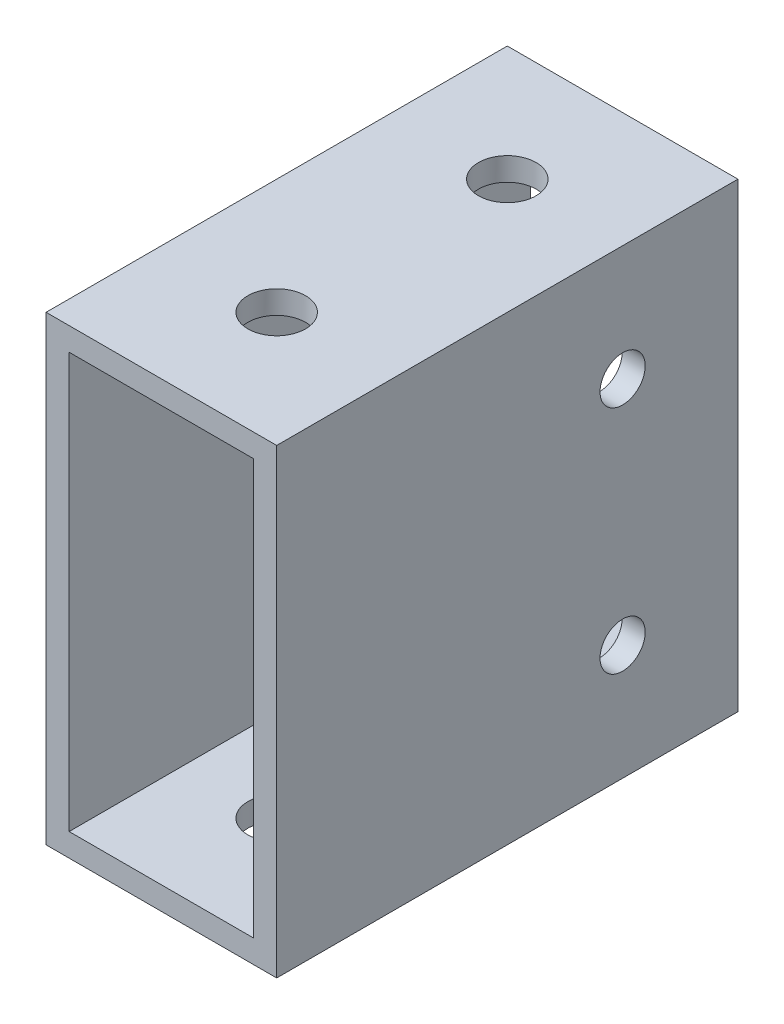
ISO-10303-21;
HEADER;
FILE_DESCRIPTION(('STEP AP214'),'2;1');
FILE_NAME('part.step','',(''),(''),'','','');
FILE_SCHEMA(('AUTOMOTIVE_DESIGN { 1 0 10303 214 1 1 1 1 }'));
ENDSEC;
DATA;
#1=APPLICATION_CONTEXT('core data for automotive mechanical design processes');
#2=APPLICATION_PROTOCOL_DEFINITION('international standard','automotive_design',2000,#1);
#3=PRODUCT_CONTEXT('',#1,'mechanical');
#4=PRODUCT('Part','Part','',(#3));
#5=PRODUCT_RELATED_PRODUCT_CATEGORY('part','',(#4));
#6=PRODUCT_DEFINITION_FORMATION('','',#4);
#7=PRODUCT_DEFINITION_CONTEXT('part definition',#1,'design');
#8=PRODUCT_DEFINITION('design','',#6,#7);
#9=PRODUCT_DEFINITION_SHAPE('','',#8);
#10=(LENGTH_UNIT() NAMED_UNIT(*) SI_UNIT(.MILLI.,.METRE.));
#11=(NAMED_UNIT(*) PLANE_ANGLE_UNIT() SI_UNIT($,.RADIAN.));
#12=(NAMED_UNIT(*) SI_UNIT($,.STERADIAN.) SOLID_ANGLE_UNIT());
#13=UNCERTAINTY_MEASURE_WITH_UNIT(LENGTH_MEASURE(1.E-05),#10,'distance_accuracy_value','');
#14=(GEOMETRIC_REPRESENTATION_CONTEXT(3) GLOBAL_UNCERTAINTY_ASSIGNED_CONTEXT((#13)) GLOBAL_UNIT_ASSIGNED_CONTEXT((#10,
#11,#12)) REPRESENTATION_CONTEXT('',''));
#15=CARTESIAN_POINT('',(0.,0.,0.));
#16=DIRECTION('',(0.,0.,1.));
#17=DIRECTION('',(1.,0.,0.));
#18=AXIS2_PLACEMENT_3D('',#15,#16,#17);
#19=CARTESIAN_POINT('',(0.,0.,25.4));
#20=DIRECTION('',(0.,0.,1.));
#21=DIRECTION('',(1.,0.,0.));
#22=AXIS2_PLACEMENT_3D('',#19,#20,#21);
#23=PLANE('',#22);
#24=DIRECTION('',(0.,1.,0.));
#25=VECTOR('',#24,1.);
#26=CARTESIAN_POINT('',(12.7,-25.4,25.4));
#27=LINE('',#26,#25);
#28=CARTESIAN_POINT('',(12.7,-25.4,25.4));
#29=VERTEX_POINT('',#28);
#30=CARTESIAN_POINT('',(12.7,25.4,25.4));
#31=VERTEX_POINT('',#30);
#32=EDGE_CURVE('E163',#29,#31,#27,.T.);
#33=ORIENTED_EDGE('',*,*,#32,.T.);
#34=DIRECTION('',(-1.,0.,0.));
#35=VECTOR('',#34,1.);
#36=CARTESIAN_POINT('',(-12.7,25.4,25.4));
#37=LINE('',#36,#35);
#38=CARTESIAN_POINT('',(-12.7,25.4,25.4));
#39=VERTEX_POINT('',#38);
#40=EDGE_CURVE('E166',#31,#39,#37,.T.);
#41=ORIENTED_EDGE('',*,*,#40,.T.);
#42=DIRECTION('',(0.,-1.,0.));
#43=VECTOR('',#42,1.);
#44=CARTESIAN_POINT('',(-12.7,-25.4,25.4));
#45=LINE('',#44,#43);
#46=CARTESIAN_POINT('',(-12.7,-25.4,25.4));
#47=VERTEX_POINT('',#46);
#48=EDGE_CURVE('E169',#39,#47,#45,.T.);
#49=ORIENTED_EDGE('',*,*,#48,.T.);
#50=DIRECTION('',(1.,0.,0.));
#51=VECTOR('',#50,1.);
#52=CARTESIAN_POINT('',(-12.7,-25.4,25.4));
#53=LINE('',#52,#51);
#54=EDGE_CURVE('E171',#47,#29,#53,.T.);
#55=ORIENTED_EDGE('',*,*,#54,.T.);
#56=EDGE_LOOP('',(#33,#41,#49,#55));
#57=FACE_BOUND('',#56,.T.);
#58=DIRECTION('',(-1.,0.,0.));
#59=VECTOR('',#58,1.);
#60=CARTESIAN_POINT('',(0.,22.86,25.4));
#61=LINE('',#60,#59);
#62=CARTESIAN_POINT('',(10.16,22.86,25.4));
#63=VERTEX_POINT('',#62);
#64=CARTESIAN_POINT('',(-10.16,22.86,25.4));
#65=VERTEX_POINT('',#64);
#66=EDGE_CURVE('E133',#63,#65,#61,.T.);
#67=ORIENTED_EDGE('',*,*,#66,.F.);
#68=DIRECTION('',(0.,1.,0.));
#69=VECTOR('',#68,1.);
#70=CARTESIAN_POINT('',(10.16,0.,25.4));
#71=LINE('',#70,#69);
#72=CARTESIAN_POINT('',(10.16,-22.86,25.4));
#73=VERTEX_POINT('',#72);
#74=EDGE_CURVE('E125',#73,#63,#71,.T.);
#75=ORIENTED_EDGE('',*,*,#74,.F.);
#76=DIRECTION('',(1.,0.,0.));
#77=VECTOR('',#76,1.);
#78=CARTESIAN_POINT('',(0.,-22.86,25.4));
#79=LINE('',#78,#77);
#80=CARTESIAN_POINT('',(-10.16,-22.86,25.4));
#81=VERTEX_POINT('',#80);
#82=EDGE_CURVE('E147',#81,#73,#79,.T.);
#83=ORIENTED_EDGE('',*,*,#82,.F.);
#84=DIRECTION('',(0.,-1.,0.));
#85=VECTOR('',#84,1.);
#86=CARTESIAN_POINT('',(-10.16,0.,25.4));
#87=LINE('',#86,#85);
#88=EDGE_CURVE('E145',#65,#81,#87,.T.);
#89=ORIENTED_EDGE('',*,*,#88,.F.);
#90=EDGE_LOOP('',(#67,#75,#83,#89));
#91=FACE_BOUND('',#90,.T.);
#92=ADVANCED_FACE('F58',(#57,#91),#23,.T.);
#93=CARTESIAN_POINT('',(0.,0.,-25.4));
#94=DIRECTION('',(0.,0.,1.));
#95=DIRECTION('',(1.,0.,0.));
#96=AXIS2_PLACEMENT_3D('',#93,#94,#95);
#97=PLANE('',#96);
#98=DIRECTION('',(0.,1.,0.));
#99=VECTOR('',#98,1.);
#100=CARTESIAN_POINT('',(12.7,-25.4,-25.4));
#101=LINE('',#100,#99);
#102=CARTESIAN_POINT('',(12.7,-25.4,-25.4));
#103=VERTEX_POINT('',#102);
#104=CARTESIAN_POINT('',(12.7,25.4,-25.4));
#105=VERTEX_POINT('',#104);
#106=EDGE_CURVE('E141',#103,#105,#101,.T.);
#107=ORIENTED_EDGE('',*,*,#106,.F.);
#108=DIRECTION('',(1.,0.,0.));
#109=VECTOR('',#108,1.);
#110=CARTESIAN_POINT('',(-12.7,-25.4,-25.4));
#111=LINE('',#110,#109);
#112=CARTESIAN_POINT('',(-12.7,-25.4,-25.4));
#113=VERTEX_POINT('',#112);
#114=EDGE_CURVE('E167',#113,#103,#111,.T.);
#115=ORIENTED_EDGE('',*,*,#114,.F.);
#116=DIRECTION('',(0.,-1.,0.));
#117=VECTOR('',#116,1.);
#118=CARTESIAN_POINT('',(-12.7,-25.4,-25.4));
#119=LINE('',#118,#117);
#120=CARTESIAN_POINT('',(-12.7,25.4,-25.4));
#121=VERTEX_POINT('',#120);
#122=EDGE_CURVE('E178',#121,#113,#119,.T.);
#123=ORIENTED_EDGE('',*,*,#122,.F.);
#124=DIRECTION('',(-1.,0.,0.));
#125=VECTOR('',#124,1.);
#126=CARTESIAN_POINT('',(-12.7,25.4,-25.4));
#127=LINE('',#126,#125);
#128=EDGE_CURVE('E176',#105,#121,#127,.T.);
#129=ORIENTED_EDGE('',*,*,#128,.F.);
#130=EDGE_LOOP('',(#107,#115,#123,#129));
#131=FACE_BOUND('',#130,.T.);
#132=DIRECTION('',(0.,1.,0.));
#133=VECTOR('',#132,1.);
#134=CARTESIAN_POINT('',(10.16,0.,-25.4));
#135=LINE('',#134,#133);
#136=CARTESIAN_POINT('',(10.16,-22.86,-25.4));
#137=VERTEX_POINT('',#136);
#138=CARTESIAN_POINT('',(10.16,22.86,-25.4));
#139=VERTEX_POINT('',#138);
#140=EDGE_CURVE('E83',#137,#139,#135,.T.);
#141=ORIENTED_EDGE('',*,*,#140,.T.);
#142=DIRECTION('',(-1.,0.,0.));
#143=VECTOR('',#142,1.);
#144=CARTESIAN_POINT('',(0.,22.86,-25.4));
#145=LINE('',#144,#143);
#146=CARTESIAN_POINT('',(-10.16,22.86,-25.4));
#147=VERTEX_POINT('',#146);
#148=EDGE_CURVE('E140',#139,#147,#145,.T.);
#149=ORIENTED_EDGE('',*,*,#148,.T.);
#150=DIRECTION('',(0.,-1.,0.));
#151=VECTOR('',#150,1.);
#152=CARTESIAN_POINT('',(-10.16,0.,-25.4));
#153=LINE('',#152,#151);
#154=CARTESIAN_POINT('',(-10.16,-22.86,-25.4));
#155=VERTEX_POINT('',#154);
#156=EDGE_CURVE('E155',#147,#155,#153,.T.);
#157=ORIENTED_EDGE('',*,*,#156,.T.);
#158=DIRECTION('',(1.,0.,0.));
#159=VECTOR('',#158,1.);
#160=CARTESIAN_POINT('',(0.,-22.86,-25.4));
#161=LINE('',#160,#159);
#162=EDGE_CURVE('E134',#155,#137,#161,.T.);
#163=ORIENTED_EDGE('',*,*,#162,.T.);
#164=EDGE_LOOP('',(#141,#149,#157,#163));
#165=FACE_BOUND('',#164,.T.);
#166=ADVANCED_FACE('F266',(#131,#165),#97,.F.);
#167=CARTESIAN_POINT('',(12.7,-25.4,25.4));
#168=DIRECTION('',(-1.,0.,0.));
#169=DIRECTION('',(0.,0.,1.));
#170=AXIS2_PLACEMENT_3D('',#167,#168,#169);
#171=PLANE('',#170);
#172=CARTESIAN_POINT('',(12.7,12.7,-12.7));
#173=DIRECTION('',(1.,0.,0.));
#174=DIRECTION('',(0.,0.,-1.));
#175=AXIS2_PLACEMENT_3D('',#172,#173,#174);
#176=CIRCLE('',#175,2.4892);
#177=CARTESIAN_POINT('',(12.7,12.7,-15.1892));
#178=VERTEX_POINT('',#177);
#179=EDGE_CURVE('E204',#178,#178,#176,.T.);
#180=ORIENTED_EDGE('',*,*,#179,.F.);
#181=EDGE_LOOP('',(#180));
#182=FACE_BOUND('',#181,.T.);
#183=CARTESIAN_POINT('',(12.7,-12.7,-12.7));
#184=DIRECTION('',(1.,0.,0.));
#185=DIRECTION('',(0.,0.,-1.));
#186=AXIS2_PLACEMENT_3D('',#183,#184,#185);
#187=CIRCLE('',#186,2.4892);
#188=CARTESIAN_POINT('',(12.7,-12.7,-15.1892));
#189=VERTEX_POINT('',#188);
#190=EDGE_CURVE('E214',#189,#189,#187,.T.);
#191=ORIENTED_EDGE('',*,*,#190,.F.);
#192=EDGE_LOOP('',(#191));
#193=FACE_BOUND('',#192,.T.);
#194=ORIENTED_EDGE('',*,*,#106,.T.);
#195=DIRECTION('',(0.,0.,-1.));
#196=VECTOR('',#195,1.);
#197=CARTESIAN_POINT('',(12.7,25.4,25.4));
#198=LINE('',#197,#196);
#199=EDGE_CURVE('E12',#31,#105,#198,.T.);
#200=ORIENTED_EDGE('',*,*,#199,.F.);
#201=ORIENTED_EDGE('',*,*,#32,.F.);
#202=DIRECTION('',(0.,0.,-1.));
#203=VECTOR('',#202,1.);
#204=CARTESIAN_POINT('',(12.7,-25.4,25.4));
#205=LINE('',#204,#203);
#206=EDGE_CURVE('E173',#29,#103,#205,.T.);
#207=ORIENTED_EDGE('',*,*,#206,.T.);
#208=EDGE_LOOP('',(#194,#200,#201,#207));
#209=FACE_BOUND('',#208,.T.);
#210=ADVANCED_FACE('F60',(#182,#193,#209),#171,.F.);
#211=CARTESIAN_POINT('',(-12.7,25.4,25.4));
#212=DIRECTION('',(0.,-1.,0.));
#213=DIRECTION('',(0.,0.,-1.));
#214=AXIS2_PLACEMENT_3D('',#211,#212,#213);
#215=PLANE('',#214);
#216=CARTESIAN_POINT('',(0.,25.4,-12.7));
#217=DIRECTION('',(0.,1.,0.));
#218=DIRECTION('',(0.,0.,1.));
#219=AXIS2_PLACEMENT_3D('',#216,#217,#218);
#220=CIRCLE('',#219,3.175);
#221=CARTESIAN_POINT('',(0.,25.4,-9.525));
#222=VERTEX_POINT('',#221);
#223=EDGE_CURVE('E223',#222,#222,#220,.T.);
#224=ORIENTED_EDGE('',*,*,#223,.F.);
#225=EDGE_LOOP('',(#224));
#226=FACE_BOUND('',#225,.T.);
#227=CARTESIAN_POINT('',(0.,25.4,12.7));
#228=DIRECTION('',(0.,1.,0.));
#229=DIRECTION('',(0.,0.,1.));
#230=AXIS2_PLACEMENT_3D('',#227,#228,#229);
#231=CIRCLE('',#230,3.175);
#232=CARTESIAN_POINT('',(0.,25.4,15.875));
#233=VERTEX_POINT('',#232);
#234=EDGE_CURVE('E220',#233,#233,#231,.T.);
#235=ORIENTED_EDGE('',*,*,#234,.F.);
#236=EDGE_LOOP('',(#235));
#237=FACE_BOUND('',#236,.T.);
#238=ORIENTED_EDGE('',*,*,#128,.T.);
#239=DIRECTION('',(0.,0.,-1.));
#240=VECTOR('',#239,1.);
#241=CARTESIAN_POINT('',(-12.7,25.4,25.4));
#242=LINE('',#241,#240);
#243=EDGE_CURVE('E67',#39,#121,#242,.T.);
#244=ORIENTED_EDGE('',*,*,#243,.F.);
#245=ORIENTED_EDGE('',*,*,#40,.F.);
#246=ORIENTED_EDGE('',*,*,#199,.T.);
#247=EDGE_LOOP('',(#238,#244,#245,#246));
#248=FACE_BOUND('',#247,.T.);
#249=ADVANCED_FACE('F252',(#226,#237,#248),#215,.F.);
#250=CARTESIAN_POINT('',(-12.7,-25.4,25.4));
#251=DIRECTION('',(1.,0.,0.));
#252=DIRECTION('',(0.,0.,-1.));
#253=AXIS2_PLACEMENT_3D('',#250,#251,#252);
#254=PLANE('',#253);
#255=CARTESIAN_POINT('',(-12.7,12.7,-12.7));
#256=DIRECTION('',(1.,0.,0.));
#257=DIRECTION('',(0.,0.,-1.));
#258=AXIS2_PLACEMENT_3D('',#255,#256,#257);
#259=CIRCLE('',#258,2.4892);
#260=CARTESIAN_POINT('',(-12.7,12.7,-15.1892));
#261=VERTEX_POINT('',#260);
#262=EDGE_CURVE('E198',#261,#261,#259,.T.);
#263=ORIENTED_EDGE('',*,*,#262,.T.);
#264=EDGE_LOOP('',(#263));
#265=FACE_BOUND('',#264,.T.);
#266=CARTESIAN_POINT('',(-12.7,-12.7,-12.7));
#267=DIRECTION('',(1.,0.,0.));
#268=DIRECTION('',(0.,0.,-1.));
#269=AXIS2_PLACEMENT_3D('',#266,#267,#268);
#270=CIRCLE('',#269,2.4892);
#271=CARTESIAN_POINT('',(-12.7,-12.7,-15.1892));
#272=VERTEX_POINT('',#271);
#273=EDGE_CURVE('E209',#272,#272,#270,.T.);
#274=ORIENTED_EDGE('',*,*,#273,.T.);
#275=EDGE_LOOP('',(#274));
#276=FACE_BOUND('',#275,.T.);
#277=ORIENTED_EDGE('',*,*,#122,.T.);
#278=DIRECTION('',(0.,0.,-1.));
#279=VECTOR('',#278,1.);
#280=CARTESIAN_POINT('',(-12.7,-25.4,25.4));
#281=LINE('',#280,#279);
#282=EDGE_CURVE('E183',#47,#113,#281,.T.);
#283=ORIENTED_EDGE('',*,*,#282,.F.);
#284=ORIENTED_EDGE('',*,*,#48,.F.);
#285=ORIENTED_EDGE('',*,*,#243,.T.);
#286=EDGE_LOOP('',(#277,#283,#284,#285));
#287=FACE_BOUND('',#286,.T.);
#288=ADVANCED_FACE('F255',(#265,#276,#287),#254,.F.);
#289=CARTESIAN_POINT('',(-12.7,-25.4,25.4));
#290=DIRECTION('',(0.,1.,0.));
#291=DIRECTION('',(0.,0.,1.));
#292=AXIS2_PLACEMENT_3D('',#289,#290,#291);
#293=PLANE('',#292);
#294=CARTESIAN_POINT('',(0.,-25.4,-12.7));
#295=DIRECTION('',(0.,1.,0.));
#296=DIRECTION('',(0.,0.,1.));
#297=AXIS2_PLACEMENT_3D('',#294,#295,#296);
#298=CIRCLE('',#297,3.175);
#299=CARTESIAN_POINT('',(0.,-25.4,-9.525));
#300=VERTEX_POINT('',#299);
#301=EDGE_CURVE('E192',#300,#300,#298,.T.);
#302=ORIENTED_EDGE('',*,*,#301,.T.);
#303=EDGE_LOOP('',(#302));
#304=FACE_BOUND('',#303,.T.);
#305=CARTESIAN_POINT('',(0.,-25.4,12.7));
#306=DIRECTION('',(0.,1.,0.));
#307=DIRECTION('',(0.,0.,1.));
#308=AXIS2_PLACEMENT_3D('',#305,#306,#307);
#309=CIRCLE('',#308,3.175);
#310=CARTESIAN_POINT('',(0.,-25.4,15.875));
#311=VERTEX_POINT('',#310);
#312=EDGE_CURVE('E226',#311,#311,#309,.T.);
#313=ORIENTED_EDGE('',*,*,#312,.T.);
#314=EDGE_LOOP('',(#313));
#315=FACE_BOUND('',#314,.T.);
#316=ORIENTED_EDGE('',*,*,#114,.T.);
#317=ORIENTED_EDGE('',*,*,#206,.F.);
#318=ORIENTED_EDGE('',*,*,#54,.F.);
#319=ORIENTED_EDGE('',*,*,#282,.T.);
#320=EDGE_LOOP('',(#316,#317,#318,#319));
#321=FACE_BOUND('',#320,.T.);
#322=ADVANCED_FACE('F270',(#304,#315,#321),#293,.F.);
#323=CARTESIAN_POINT('',(10.16,0.,25.4));
#324=DIRECTION('',(-1.,0.,0.));
#325=DIRECTION('',(0.,0.,1.));
#326=AXIS2_PLACEMENT_3D('',#323,#324,#325);
#327=PLANE('',#326);
#328=CARTESIAN_POINT('',(10.16,12.7,-12.7));
#329=DIRECTION('',(-1.,0.,0.));
#330=DIRECTION('',(0.,0.,1.));
#331=AXIS2_PLACEMENT_3D('',#328,#329,#330);
#332=CIRCLE('',#331,2.4892);
#333=CARTESIAN_POINT('',(10.16,12.7,-10.2108));
#334=VERTEX_POINT('',#333);
#335=EDGE_CURVE('E217',#334,#334,#332,.T.);
#336=ORIENTED_EDGE('',*,*,#335,.F.);
#337=EDGE_LOOP('',(#336));
#338=FACE_BOUND('',#337,.T.);
#339=CARTESIAN_POINT('',(10.16,-12.7,-12.7));
#340=DIRECTION('',(-1.,0.,0.));
#341=DIRECTION('',(0.,0.,1.));
#342=AXIS2_PLACEMENT_3D('',#339,#340,#341);
#343=CIRCLE('',#342,2.4892);
#344=CARTESIAN_POINT('',(10.16,-12.7,-10.2108));
#345=VERTEX_POINT('',#344);
#346=EDGE_CURVE('E197',#345,#345,#343,.T.);
#347=ORIENTED_EDGE('',*,*,#346,.F.);
#348=EDGE_LOOP('',(#347));
#349=FACE_BOUND('',#348,.T.);
#350=ORIENTED_EDGE('',*,*,#140,.F.);
#351=DIRECTION('',(0.,0.,-1.));
#352=VECTOR('',#351,1.);
#353=CARTESIAN_POINT('',(10.16,-22.86,25.4));
#354=LINE('',#353,#352);
#355=EDGE_CURVE('E129',#73,#137,#354,.T.);
#356=ORIENTED_EDGE('',*,*,#355,.F.);
#357=ORIENTED_EDGE('',*,*,#74,.T.);
#358=DIRECTION('',(0.,0.,-1.));
#359=VECTOR('',#358,1.);
#360=CARTESIAN_POINT('',(10.16,22.86,25.4));
#361=LINE('',#360,#359);
#362=EDGE_CURVE('E128',#63,#139,#361,.T.);
#363=ORIENTED_EDGE('',*,*,#362,.T.);
#364=EDGE_LOOP('',(#350,#356,#357,#363));
#365=FACE_BOUND('',#364,.T.);
#366=ADVANCED_FACE('F127',(#338,#349,#365),#327,.T.);
#367=CARTESIAN_POINT('',(0.,22.86,25.4));
#368=DIRECTION('',(0.,-1.,0.));
#369=DIRECTION('',(0.,0.,-1.));
#370=AXIS2_PLACEMENT_3D('',#367,#368,#369);
#371=PLANE('',#370);
#372=CARTESIAN_POINT('',(0.,22.86,-12.7));
#373=DIRECTION('',(0.,-1.,0.));
#374=DIRECTION('',(0.,0.,-1.));
#375=AXIS2_PLACEMENT_3D('',#372,#373,#374);
#376=CIRCLE('',#375,3.175);
#377=CARTESIAN_POINT('',(0.,22.86,-15.875));
#378=VERTEX_POINT('',#377);
#379=EDGE_CURVE('E153',#378,#378,#376,.T.);
#380=ORIENTED_EDGE('',*,*,#379,.F.);
#381=EDGE_LOOP('',(#380));
#382=FACE_BOUND('',#381,.T.);
#383=CARTESIAN_POINT('',(0.,22.86,12.7));
#384=DIRECTION('',(0.,-1.,0.));
#385=DIRECTION('',(0.,0.,-1.));
#386=AXIS2_PLACEMENT_3D('',#383,#384,#385);
#387=CIRCLE('',#386,3.175);
#388=CARTESIAN_POINT('',(0.,22.86,9.525));
#389=VERTEX_POINT('',#388);
#390=EDGE_CURVE('E191',#389,#389,#387,.T.);
#391=ORIENTED_EDGE('',*,*,#390,.F.);
#392=EDGE_LOOP('',(#391));
#393=FACE_BOUND('',#392,.T.);
#394=ORIENTED_EDGE('',*,*,#148,.F.);
#395=ORIENTED_EDGE('',*,*,#362,.F.);
#396=ORIENTED_EDGE('',*,*,#66,.T.);
#397=DIRECTION('',(0.,0.,-1.));
#398=VECTOR('',#397,1.);
#399=CARTESIAN_POINT('',(-10.16,22.86,25.4));
#400=LINE('',#399,#398);
#401=EDGE_CURVE('E142',#65,#147,#400,.T.);
#402=ORIENTED_EDGE('',*,*,#401,.T.);
#403=EDGE_LOOP('',(#394,#395,#396,#402));
#404=FACE_BOUND('',#403,.T.);
#405=ADVANCED_FACE('F137',(#382,#393,#404),#371,.T.);
#406=CARTESIAN_POINT('',(-10.16,0.,25.4));
#407=DIRECTION('',(1.,0.,0.));
#408=DIRECTION('',(0.,0.,-1.));
#409=AXIS2_PLACEMENT_3D('',#406,#407,#408);
#410=PLANE('',#409);
#411=CARTESIAN_POINT('',(-10.16,12.7,-12.7));
#412=DIRECTION('',(1.,0.,0.));
#413=DIRECTION('',(0.,0.,-1.));
#414=AXIS2_PLACEMENT_3D('',#411,#412,#413);
#415=CIRCLE('',#414,2.4892);
#416=CARTESIAN_POINT('',(-10.16,12.7,-15.1892));
#417=VERTEX_POINT('',#416);
#418=EDGE_CURVE('E62',#417,#417,#415,.T.);
#419=ORIENTED_EDGE('',*,*,#418,.F.);
#420=EDGE_LOOP('',(#419));
#421=FACE_BOUND('',#420,.T.);
#422=CARTESIAN_POINT('',(-10.16,-12.7,-12.7));
#423=DIRECTION('',(1.,0.,0.));
#424=DIRECTION('',(0.,0.,-1.));
#425=AXIS2_PLACEMENT_3D('',#422,#423,#424);
#426=CIRCLE('',#425,2.4892);
#427=CARTESIAN_POINT('',(-10.16,-12.7,-15.1892));
#428=VERTEX_POINT('',#427);
#429=EDGE_CURVE('E195',#428,#428,#426,.T.);
#430=ORIENTED_EDGE('',*,*,#429,.F.);
#431=EDGE_LOOP('',(#430));
#432=FACE_BOUND('',#431,.T.);
#433=ORIENTED_EDGE('',*,*,#156,.F.);
#434=ORIENTED_EDGE('',*,*,#401,.F.);
#435=ORIENTED_EDGE('',*,*,#88,.T.);
#436=DIRECTION('',(0.,0.,-1.));
#437=VECTOR('',#436,1.);
#438=CARTESIAN_POINT('',(-10.16,-22.86,25.4));
#439=LINE('',#438,#437);
#440=EDGE_CURVE('E75',#81,#155,#439,.T.);
#441=ORIENTED_EDGE('',*,*,#440,.T.);
#442=EDGE_LOOP('',(#433,#434,#435,#441));
#443=FACE_BOUND('',#442,.T.);
#444=ADVANCED_FACE('F240',(#421,#432,#443),#410,.T.);
#445=CARTESIAN_POINT('',(0.,-22.86,25.4));
#446=DIRECTION('',(0.,1.,0.));
#447=DIRECTION('',(0.,0.,1.));
#448=AXIS2_PLACEMENT_3D('',#445,#446,#447);
#449=PLANE('',#448);
#450=CARTESIAN_POINT('',(0.,-22.86,-12.7));
#451=DIRECTION('',(0.,1.,0.));
#452=DIRECTION('',(0.,0.,1.));
#453=AXIS2_PLACEMENT_3D('',#450,#451,#452);
#454=CIRCLE('',#453,3.175);
#455=CARTESIAN_POINT('',(0.,-22.86,-9.525));
#456=VERTEX_POINT('',#455);
#457=EDGE_CURVE('E193',#456,#456,#454,.T.);
#458=ORIENTED_EDGE('',*,*,#457,.F.);
#459=EDGE_LOOP('',(#458));
#460=FACE_BOUND('',#459,.T.);
#461=CARTESIAN_POINT('',(0.,-22.86,12.7));
#462=DIRECTION('',(0.,1.,0.));
#463=DIRECTION('',(0.,0.,1.));
#464=AXIS2_PLACEMENT_3D('',#461,#462,#463);
#465=CIRCLE('',#464,3.175);
#466=CARTESIAN_POINT('',(0.,-22.86,15.875));
#467=VERTEX_POINT('',#466);
#468=EDGE_CURVE('E188',#467,#467,#465,.T.);
#469=ORIENTED_EDGE('',*,*,#468,.F.);
#470=EDGE_LOOP('',(#469));
#471=FACE_BOUND('',#470,.T.);
#472=ORIENTED_EDGE('',*,*,#162,.F.);
#473=ORIENTED_EDGE('',*,*,#440,.F.);
#474=ORIENTED_EDGE('',*,*,#82,.T.);
#475=ORIENTED_EDGE('',*,*,#355,.T.);
#476=EDGE_LOOP('',(#472,#473,#474,#475));
#477=FACE_BOUND('',#476,.T.);
#478=ADVANCED_FACE('F352',(#460,#471,#477),#449,.T.);
#479=CARTESIAN_POINT('',(0.,-25.4,12.7));
#480=DIRECTION('',(0.,1.,0.));
#481=DIRECTION('',(0.,0.,1.));
#482=AXIS2_PLACEMENT_3D('',#479,#480,#481);
#483=CYLINDRICAL_SURFACE('',#482,3.175);
#484=ORIENTED_EDGE('',*,*,#468,.T.);
#485=EDGE_LOOP('',(#484));
#486=FACE_BOUND('',#485,.T.);
#487=ORIENTED_EDGE('',*,*,#312,.F.);
#488=EDGE_LOOP('',(#487));
#489=FACE_BOUND('',#488,.T.);
#490=ADVANCED_FACE('F249',(#486,#489),#483,.F.);
#491=CARTESIAN_POINT('',(0.,-25.4,-12.7));
#492=DIRECTION('',(0.,1.,0.));
#493=DIRECTION('',(0.,0.,1.));
#494=AXIS2_PLACEMENT_3D('',#491,#492,#493);
#495=CYLINDRICAL_SURFACE('',#494,3.175);
#496=ORIENTED_EDGE('',*,*,#457,.T.);
#497=EDGE_LOOP('',(#496));
#498=FACE_BOUND('',#497,.T.);
#499=ORIENTED_EDGE('',*,*,#301,.F.);
#500=EDGE_LOOP('',(#499));
#501=FACE_BOUND('',#500,.T.);
#502=ADVANCED_FACE('F247',(#498,#501),#495,.F.);
#503=ORIENTED_EDGE('',*,*,#390,.T.);
#504=EDGE_LOOP('',(#503));
#505=FACE_BOUND('',#504,.T.);
#506=ORIENTED_EDGE('',*,*,#234,.T.);
#507=EDGE_LOOP('',(#506));
#508=FACE_BOUND('',#507,.T.);
#509=ADVANCED_FACE('F244',(#505,#508),#483,.F.);
#510=ORIENTED_EDGE('',*,*,#379,.T.);
#511=EDGE_LOOP('',(#510));
#512=FACE_BOUND('',#511,.T.);
#513=ORIENTED_EDGE('',*,*,#223,.T.);
#514=EDGE_LOOP('',(#513));
#515=FACE_BOUND('',#514,.T.);
#516=ADVANCED_FACE('F235',(#512,#515),#495,.F.);
#517=CARTESIAN_POINT('',(-12.7,-12.7,-12.7));
#518=DIRECTION('',(1.,0.,0.));
#519=DIRECTION('',(0.,0.,-1.));
#520=AXIS2_PLACEMENT_3D('',#517,#518,#519);
#521=CYLINDRICAL_SURFACE('',#520,2.4892);
#522=ORIENTED_EDGE('',*,*,#429,.T.);
#523=EDGE_LOOP('',(#522));
#524=FACE_BOUND('',#523,.T.);
#525=ORIENTED_EDGE('',*,*,#273,.F.);
#526=EDGE_LOOP('',(#525));
#527=FACE_BOUND('',#526,.T.);
#528=ADVANCED_FACE('F292',(#524,#527),#521,.F.);
#529=CARTESIAN_POINT('',(-12.7,12.7,-12.7));
#530=DIRECTION('',(1.,0.,0.));
#531=DIRECTION('',(0.,0.,-1.));
#532=AXIS2_PLACEMENT_3D('',#529,#530,#531);
#533=CYLINDRICAL_SURFACE('',#532,2.4892);
#534=ORIENTED_EDGE('',*,*,#418,.T.);
#535=EDGE_LOOP('',(#534));
#536=FACE_BOUND('',#535,.T.);
#537=ORIENTED_EDGE('',*,*,#262,.F.);
#538=EDGE_LOOP('',(#537));
#539=FACE_BOUND('',#538,.T.);
#540=ADVANCED_FACE('F294',(#536,#539),#533,.F.);
#541=ORIENTED_EDGE('',*,*,#346,.T.);
#542=EDGE_LOOP('',(#541));
#543=FACE_BOUND('',#542,.T.);
#544=ORIENTED_EDGE('',*,*,#190,.T.);
#545=EDGE_LOOP('',(#544));
#546=FACE_BOUND('',#545,.T.);
#547=ADVANCED_FACE('F296',(#543,#546),#521,.F.);
#548=ORIENTED_EDGE('',*,*,#335,.T.);
#549=EDGE_LOOP('',(#548));
#550=FACE_BOUND('',#549,.T.);
#551=ORIENTED_EDGE('',*,*,#179,.T.);
#552=EDGE_LOOP('',(#551));
#553=FACE_BOUND('',#552,.T.);
#554=ADVANCED_FACE('F303',(#550,#553),#533,.F.);
#555=CLOSED_SHELL('',(#92,#166,#210,#249,#288,#322,#366,#405,#444,#478,#490,#502,#509,#516,#528,
#540,#547,#554));
#556=MANIFOLD_SOLID_BREP('B2',#555);
#557=ADVANCED_BREP_SHAPE_REPRESENTATION('',(#18,#556),#14);
#558=SHAPE_DEFINITION_REPRESENTATION(#9,#557);
ENDSEC;
END-ISO-10303-21;
